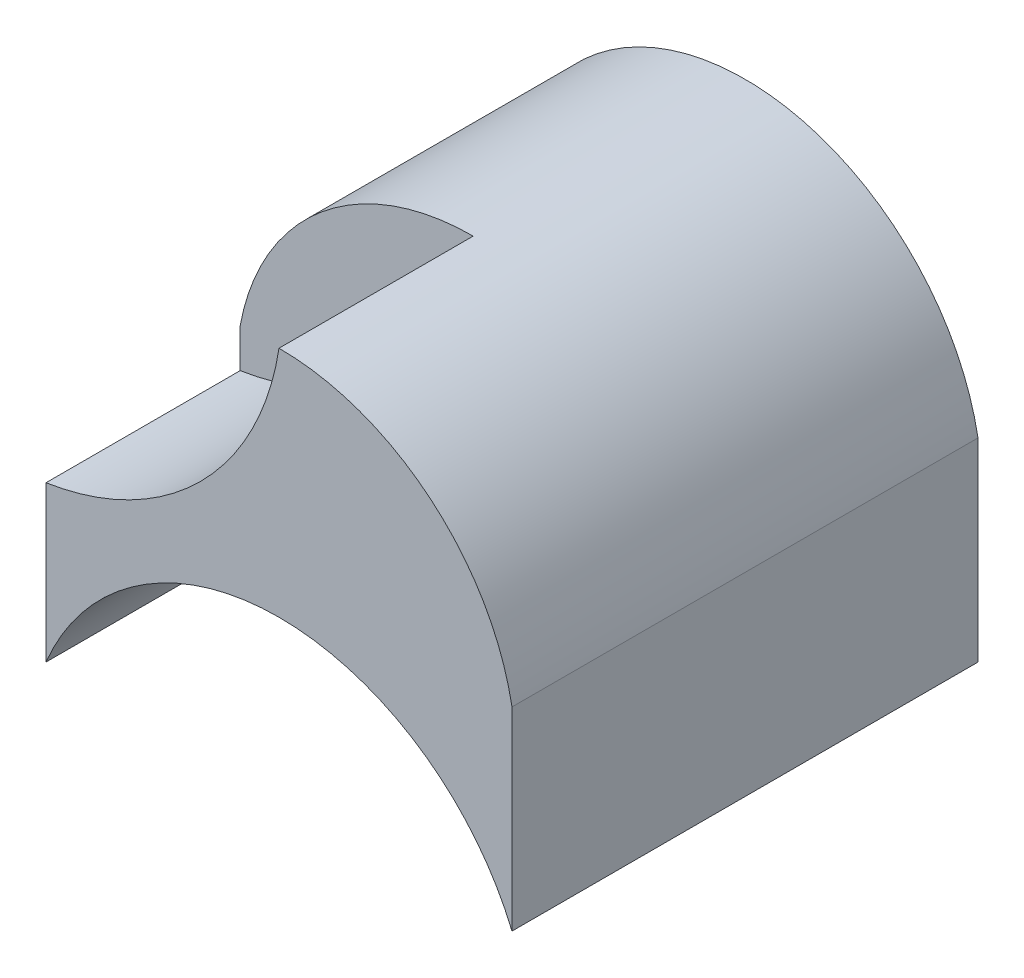
ISO-10303-21;
HEADER;
FILE_DESCRIPTION(('STEP AP214'),'2;1');
FILE_NAME('part.step','',(''),(''),'','','');
FILE_SCHEMA(('AUTOMOTIVE_DESIGN { 1 0 10303 214 1 1 1 1 }'));
ENDSEC;
DATA;
#1=APPLICATION_CONTEXT('core data for automotive mechanical design processes');
#2=APPLICATION_PROTOCOL_DEFINITION('international standard','automotive_design',2000,#1);
#3=PRODUCT_CONTEXT('',#1,'mechanical');
#4=PRODUCT('Part','Part','',(#3));
#5=PRODUCT_RELATED_PRODUCT_CATEGORY('part','',(#4));
#6=PRODUCT_DEFINITION_FORMATION('','',#4);
#7=PRODUCT_DEFINITION_CONTEXT('part definition',#1,'design');
#8=PRODUCT_DEFINITION('design','',#6,#7);
#9=PRODUCT_DEFINITION_SHAPE('','',#8);
#10=(LENGTH_UNIT() NAMED_UNIT(*) SI_UNIT(.MILLI.,.METRE.));
#11=(NAMED_UNIT(*) PLANE_ANGLE_UNIT() SI_UNIT($,.RADIAN.));
#12=(NAMED_UNIT(*) SI_UNIT($,.STERADIAN.) SOLID_ANGLE_UNIT());
#13=UNCERTAINTY_MEASURE_WITH_UNIT(LENGTH_MEASURE(1.E-05),#10,'distance_accuracy_value','');
#14=(GEOMETRIC_REPRESENTATION_CONTEXT(3) GLOBAL_UNCERTAINTY_ASSIGNED_CONTEXT((#13)) GLOBAL_UNIT_ASSIGNED_CONTEXT((#10,
#11,#12)) REPRESENTATION_CONTEXT('',''));
#15=CARTESIAN_POINT('',(0.,0.,0.));
#16=DIRECTION('',(0.,0.,1.));
#17=DIRECTION('',(1.,0.,0.));
#18=AXIS2_PLACEMENT_3D('',#15,#16,#17);
#19=CARTESIAN_POINT('',(-3.,5.,-3.));
#20=DIRECTION('',(0.,0.,1.));
#21=DIRECTION('',(1.,0.,0.));
#22=AXIS2_PLACEMENT_3D('',#19,#20,#21);
#23=PLANE('',#22);
#24=CARTESIAN_POINT('',(0.,1.95,-3.));
#25=DIRECTION('',(0.,0.,1.));
#26=DIRECTION('',(1.,0.,0.));
#27=AXIS2_PLACEMENT_3D('',#24,#25,#26);
#28=CIRCLE('',#27,3.05);
#29=CARTESIAN_POINT('',(-3.,2.5,-3.));
#30=VERTEX_POINT('',#29);
#31=CARTESIAN_POINT('',(3.,2.5,-3.));
#32=VERTEX_POINT('',#31);
#33=EDGE_CURVE('E135',#30,#32,#28,.F.);
#34=ORIENTED_EDGE('',*,*,#33,.T.);
#35=DIRECTION('',(0.,-1.,0.));
#36=VECTOR('',#35,1.);
#37=CARTESIAN_POINT('',(3.,5.,-3.));
#38=LINE('',#37,#36);
#39=CARTESIAN_POINT('',(3.,0.,-3.));
#40=VERTEX_POINT('',#39);
#41=EDGE_CURVE('E59',#32,#40,#38,.T.);
#42=ORIENTED_EDGE('',*,*,#41,.T.);
#43=CARTESIAN_POINT('',(0.,-1.25,-3.));
#44=DIRECTION('',(0.,0.,1.));
#45=DIRECTION('',(1.,0.,0.));
#46=AXIS2_PLACEMENT_3D('',#43,#44,#45);
#47=CIRCLE('',#46,3.25);
#48=CARTESIAN_POINT('',(-3.,0.,-3.));
#49=VERTEX_POINT('',#48);
#50=EDGE_CURVE('E129',#49,#40,#47,.F.);
#51=ORIENTED_EDGE('',*,*,#50,.F.);
#52=DIRECTION('',(0.,-1.,0.));
#53=VECTOR('',#52,1.);
#54=CARTESIAN_POINT('',(-3.,5.,-3.));
#55=LINE('',#54,#53);
#56=EDGE_CURVE('E146',#30,#49,#55,.T.);
#57=ORIENTED_EDGE('',*,*,#56,.F.);
#58=EDGE_LOOP('',(#34,#42,#51,#57));
#59=FACE_BOUND('',#58,.T.);
#60=ADVANCED_FACE('F51',(#59),#23,.F.);
#61=CARTESIAN_POINT('',(-3.,5.,3.));
#62=DIRECTION('',(0.,0.,-1.));
#63=DIRECTION('',(-1.,0.,0.));
#64=AXIS2_PLACEMENT_3D('',#61,#62,#63);
#65=PLANE('',#64);
#66=CARTESIAN_POINT('',(0.,1.95,3.));
#67=DIRECTION('',(0.,0.,1.));
#68=DIRECTION('',(1.,0.,0.));
#69=AXIS2_PLACEMENT_3D('',#66,#67,#68);
#70=CIRCLE('',#69,3.05);
#71=CARTESIAN_POINT('',(0.,5.,3.));
#72=VERTEX_POINT('',#71);
#73=CARTESIAN_POINT('',(3.,2.5,3.));
#74=VERTEX_POINT('',#73);
#75=EDGE_CURVE('E131',#72,#74,#70,.F.);
#76=ORIENTED_EDGE('',*,*,#75,.F.);
#77=CARTESIAN_POINT('',(-3.55004636808492,5.55004636808492,3.));
#78=DIRECTION('',(0.,0.,1.));
#79=DIRECTION('',(1.,0.,0.));
#80=AXIS2_PLACEMENT_3D('',#77,#78,#79);
#81=CIRCLE('',#80,3.59240591005475);
#82=CARTESIAN_POINT('',(-3.,2.,3.));
#83=VERTEX_POINT('',#82);
#84=EDGE_CURVE('E118',#83,#72,#81,.T.);
#85=ORIENTED_EDGE('',*,*,#84,.F.);
#86=DIRECTION('',(0.,-1.,0.));
#87=VECTOR('',#86,1.);
#88=CARTESIAN_POINT('',(-3.,5.,3.));
#89=LINE('',#88,#87);
#90=CARTESIAN_POINT('',(-3.,0.,3.));
#91=VERTEX_POINT('',#90);
#92=EDGE_CURVE('E74',#83,#91,#89,.T.);
#93=ORIENTED_EDGE('',*,*,#92,.T.);
#94=CARTESIAN_POINT('',(0.,-1.25,3.));
#95=DIRECTION('',(0.,0.,1.));
#96=DIRECTION('',(1.,0.,0.));
#97=AXIS2_PLACEMENT_3D('',#94,#95,#96);
#98=CIRCLE('',#97,3.25);
#99=CARTESIAN_POINT('',(3.,0.,3.));
#100=VERTEX_POINT('',#99);
#101=EDGE_CURVE('E123',#91,#100,#98,.F.);
#102=ORIENTED_EDGE('',*,*,#101,.T.);
#103=DIRECTION('',(0.,-1.,0.));
#104=VECTOR('',#103,1.);
#105=CARTESIAN_POINT('',(3.,5.,3.));
#106=LINE('',#105,#104);
#107=EDGE_CURVE('E142',#74,#100,#106,.T.);
#108=ORIENTED_EDGE('',*,*,#107,.F.);
#109=EDGE_LOOP('',(#76,#85,#93,#102,#108));
#110=FACE_BOUND('',#109,.T.);
#111=ADVANCED_FACE('F159',(#110),#65,.F.);
#112=CARTESIAN_POINT('',(3.,5.,3.));
#113=DIRECTION('',(-1.,0.,0.));
#114=DIRECTION('',(0.,0.,1.));
#115=AXIS2_PLACEMENT_3D('',#112,#113,#114);
#116=PLANE('',#115);
#117=ORIENTED_EDGE('',*,*,#41,.F.);
#118=DIRECTION('',(0.,0.,1.));
#119=VECTOR('',#118,1.);
#120=CARTESIAN_POINT('',(3.,2.5,-9.5));
#121=LINE('',#120,#119);
#122=EDGE_CURVE('E12',#32,#74,#121,.T.);
#123=ORIENTED_EDGE('',*,*,#122,.T.);
#124=ORIENTED_EDGE('',*,*,#107,.T.);
#125=DIRECTION('',(0.,0.,-1.));
#126=VECTOR('',#125,1.);
#127=CARTESIAN_POINT('',(3.,0.,3.));
#128=LINE('',#127,#126);
#129=EDGE_CURVE('E137',#100,#40,#128,.T.);
#130=ORIENTED_EDGE('',*,*,#129,.T.);
#131=EDGE_LOOP('',(#117,#123,#124,#130));
#132=FACE_BOUND('',#131,.T.);
#133=ADVANCED_FACE('F53',(#132),#116,.F.);
#134=CARTESIAN_POINT('',(-3.,5.,3.));
#135=DIRECTION('',(1.,0.,0.));
#136=DIRECTION('',(0.,0.,-1.));
#137=AXIS2_PLACEMENT_3D('',#134,#135,#136);
#138=PLANE('',#137);
#139=ORIENTED_EDGE('',*,*,#92,.F.);
#140=DIRECTION('',(0.,0.,1.));
#141=VECTOR('',#140,1.);
#142=CARTESIAN_POINT('',(-3.,2.,0.5));
#143=LINE('',#142,#141);
#144=CARTESIAN_POINT('',(-3.,2.,0.5));
#145=VERTEX_POINT('',#144);
#146=EDGE_CURVE('E106',#145,#83,#143,.T.);
#147=ORIENTED_EDGE('',*,*,#146,.F.);
#148=DIRECTION('',(0.,-1.,0.));
#149=VECTOR('',#148,1.);
#150=CARTESIAN_POINT('',(-3.,0.,0.5));
#151=LINE('',#150,#149);
#152=CARTESIAN_POINT('',(-3.,2.5,0.5));
#153=VERTEX_POINT('',#152);
#154=EDGE_CURVE('E111',#153,#145,#151,.T.);
#155=ORIENTED_EDGE('',*,*,#154,.F.);
#156=DIRECTION('',(0.,0.,1.));
#157=VECTOR('',#156,1.);
#158=CARTESIAN_POINT('',(-3.,2.5,-9.5));
#159=LINE('',#158,#157);
#160=EDGE_CURVE('E133',#30,#153,#159,.T.);
#161=ORIENTED_EDGE('',*,*,#160,.F.);
#162=ORIENTED_EDGE('',*,*,#56,.T.);
#163=DIRECTION('',(0.,0.,1.));
#164=VECTOR('',#163,1.);
#165=CARTESIAN_POINT('',(-3.,0.,3.));
#166=LINE('',#165,#164);
#167=EDGE_CURVE('E140',#49,#91,#166,.T.);
#168=ORIENTED_EDGE('',*,*,#167,.T.);
#169=EDGE_LOOP('',(#139,#147,#155,#161,#162,#168));
#170=FACE_BOUND('',#169,.T.);
#171=ADVANCED_FACE('F120',(#170),#138,.F.);
#172=CARTESIAN_POINT('',(0.,1.95,-9.5));
#173=DIRECTION('',(0.,0.,1.));
#174=DIRECTION('',(1.,0.,0.));
#175=AXIS2_PLACEMENT_3D('',#172,#173,#174);
#176=CYLINDRICAL_SURFACE('',#175,3.05);
#177=CARTESIAN_POINT('',(0.,1.95,0.5));
#178=DIRECTION('',(0.,0.,1.));
#179=DIRECTION('',(1.,0.,0.));
#180=AXIS2_PLACEMENT_3D('',#177,#178,#179);
#181=CIRCLE('',#180,3.05);
#182=CARTESIAN_POINT('',(0.,5.,0.5));
#183=VERTEX_POINT('',#182);
#184=EDGE_CURVE('E110',#183,#153,#181,.T.);
#185=ORIENTED_EDGE('',*,*,#184,.F.);
#186=DIRECTION('',(0.,0.,1.));
#187=VECTOR('',#186,1.);
#188=CARTESIAN_POINT('',(0.,5.,0.5));
#189=LINE('',#188,#187);
#190=EDGE_CURVE('E108',#183,#72,#189,.T.);
#191=ORIENTED_EDGE('',*,*,#190,.T.);
#192=ORIENTED_EDGE('',*,*,#75,.T.);
#193=ORIENTED_EDGE('',*,*,#122,.F.);
#194=ORIENTED_EDGE('',*,*,#33,.F.);
#195=ORIENTED_EDGE('',*,*,#160,.T.);
#196=EDGE_LOOP('',(#185,#191,#192,#193,#194,#195));
#197=FACE_BOUND('',#196,.T.);
#198=ADVANCED_FACE('F161',(#197),#176,.T.);
#199=CARTESIAN_POINT('',(0.,-1.25,-9.5));
#200=DIRECTION('',(0.,0.,1.));
#201=DIRECTION('',(1.,0.,0.));
#202=AXIS2_PLACEMENT_3D('',#199,#200,#201);
#203=CYLINDRICAL_SURFACE('',#202,3.25);
#204=ORIENTED_EDGE('',*,*,#50,.T.);
#205=ORIENTED_EDGE('',*,*,#129,.F.);
#206=ORIENTED_EDGE('',*,*,#101,.F.);
#207=ORIENTED_EDGE('',*,*,#167,.F.);
#208=EDGE_LOOP('',(#204,#205,#206,#207));
#209=FACE_BOUND('',#208,.T.);
#210=ADVANCED_FACE('F157',(#209),#203,.F.);
#211=CARTESIAN_POINT('',(-3.55004636808492,5.55004636808492,0.5));
#212=DIRECTION('',(0.,0.,1.));
#213=DIRECTION('',(1.,0.,0.));
#214=AXIS2_PLACEMENT_3D('',#211,#212,#213);
#215=CYLINDRICAL_SURFACE('',#214,3.59240591005475);
#216=ORIENTED_EDGE('',*,*,#84,.T.);
#217=ORIENTED_EDGE('',*,*,#190,.F.);
#218=CARTESIAN_POINT('',(-3.55004636808492,5.55004636808492,0.5));
#219=DIRECTION('',(0.,0.,1.));
#220=DIRECTION('',(1.,0.,0.));
#221=AXIS2_PLACEMENT_3D('',#218,#219,#220);
#222=CIRCLE('',#221,3.59240591005475);
#223=EDGE_CURVE('E66',#145,#183,#222,.T.);
#224=ORIENTED_EDGE('',*,*,#223,.F.);
#225=ORIENTED_EDGE('',*,*,#146,.T.);
#226=EDGE_LOOP('',(#216,#217,#224,#225));
#227=FACE_BOUND('',#226,.T.);
#228=ADVANCED_FACE('F104',(#227),#215,.F.);
#229=CARTESIAN_POINT('',(0.,0.,0.5));
#230=DIRECTION('',(0.,0.,1.));
#231=DIRECTION('',(1.,0.,0.));
#232=AXIS2_PLACEMENT_3D('',#229,#230,#231);
#233=PLANE('',#232);
#234=ORIENTED_EDGE('',*,*,#154,.T.);
#235=ORIENTED_EDGE('',*,*,#223,.T.);
#236=ORIENTED_EDGE('',*,*,#184,.T.);
#237=EDGE_LOOP('',(#234,#235,#236));
#238=FACE_BOUND('',#237,.T.);
#239=ADVANCED_FACE('F114',(#238),#233,.T.);
#240=CLOSED_SHELL('',(#60,#111,#133,#171,#198,#210,#228,#239));
#241=MANIFOLD_SOLID_BREP('B2',#240);
#242=ADVANCED_BREP_SHAPE_REPRESENTATION('',(#18,#241),#14);
#243=SHAPE_DEFINITION_REPRESENTATION(#9,#242);
ENDSEC;
END-ISO-10303-21;
